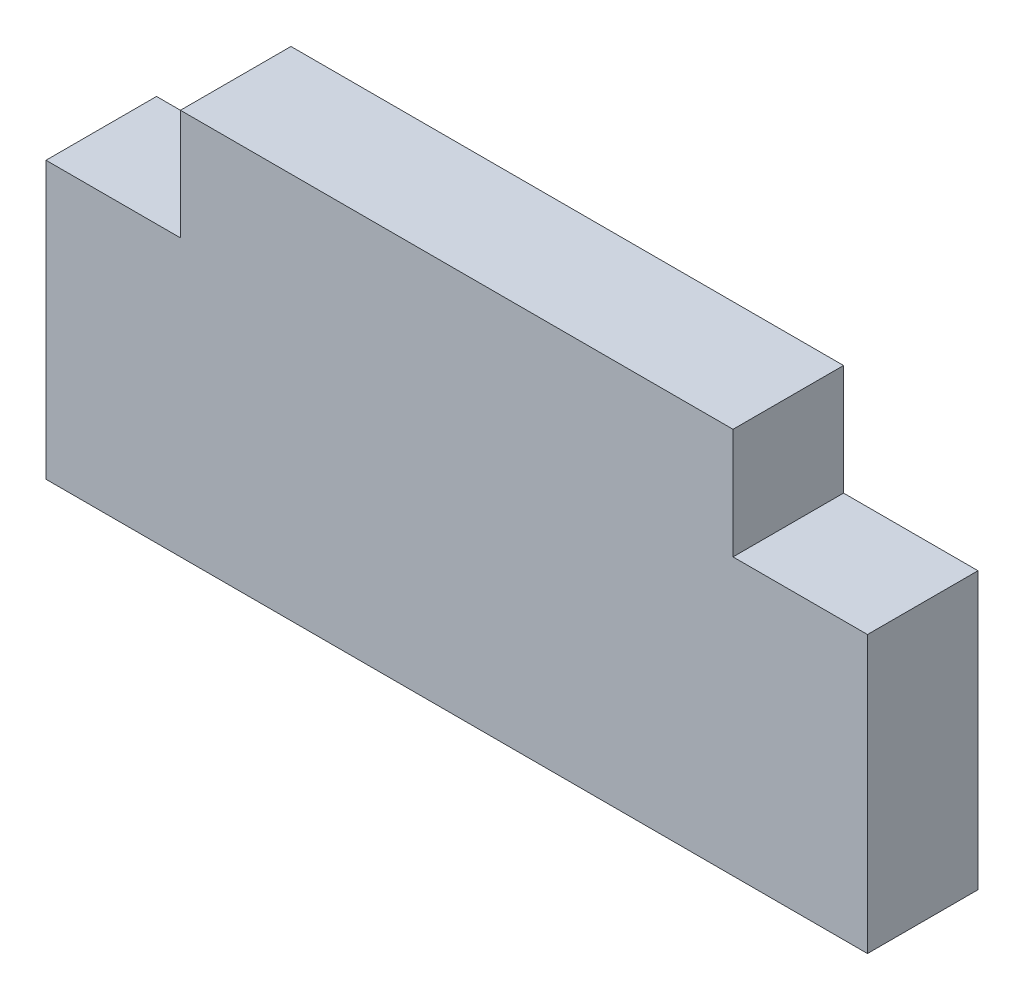
ISO-10303-21;
HEADER;
FILE_DESCRIPTION(('STEP AP214'),'2;1');
FILE_NAME('part.step','',(''),(''),'','','');
FILE_SCHEMA(('AUTOMOTIVE_DESIGN { 1 0 10303 214 1 1 1 1 }'));
ENDSEC;
DATA;
#1=APPLICATION_CONTEXT('core data for automotive mechanical design processes');
#2=APPLICATION_PROTOCOL_DEFINITION('international standard','automotive_design',2000,#1);
#3=PRODUCT_CONTEXT('',#1,'mechanical');
#4=PRODUCT('Part','Part','',(#3));
#5=PRODUCT_RELATED_PRODUCT_CATEGORY('part','',(#4));
#6=PRODUCT_DEFINITION_FORMATION('','',#4);
#7=PRODUCT_DEFINITION_CONTEXT('part definition',#1,'design');
#8=PRODUCT_DEFINITION('design','',#6,#7);
#9=PRODUCT_DEFINITION_SHAPE('','',#8);
#10=(LENGTH_UNIT() NAMED_UNIT(*) SI_UNIT(.MILLI.,.METRE.));
#11=(NAMED_UNIT(*) PLANE_ANGLE_UNIT() SI_UNIT($,.RADIAN.));
#12=(NAMED_UNIT(*) SI_UNIT($,.STERADIAN.) SOLID_ANGLE_UNIT());
#13=UNCERTAINTY_MEASURE_WITH_UNIT(LENGTH_MEASURE(1.E-05),#10,'distance_accuracy_value','');
#14=(GEOMETRIC_REPRESENTATION_CONTEXT(3) GLOBAL_UNCERTAINTY_ASSIGNED_CONTEXT((#13)) GLOBAL_UNIT_ASSIGNED_CONTEXT((#10,
#11,#12)) REPRESENTATION_CONTEXT('',''));
#15=CARTESIAN_POINT('',(0.,0.,0.));
#16=DIRECTION('',(0.,0.,1.));
#17=DIRECTION('',(1.,0.,0.));
#18=AXIS2_PLACEMENT_3D('',#15,#16,#17);
#19=CARTESIAN_POINT('',(0.,5.,0.));
#20=DIRECTION('',(0.,1.,0.));
#21=DIRECTION('',(0.,0.,1.));
#22=AXIS2_PLACEMENT_3D('',#19,#20,#21);
#23=PLANE('',#22);
#24=DIRECTION('',(0.,0.,1.));
#25=VECTOR('',#24,1.);
#26=CARTESIAN_POINT('',(-5.,5.,1.));
#27=LINE('',#26,#25);
#28=CARTESIAN_POINT('',(-5.,5.,-1.));
#29=VERTEX_POINT('',#28);
#30=CARTESIAN_POINT('',(-5.,5.,1.));
#31=VERTEX_POINT('',#30);
#32=EDGE_CURVE('E47',#29,#31,#27,.T.);
#33=ORIENTED_EDGE('',*,*,#32,.F.);
#34=DIRECTION('',(-1.,0.,0.));
#35=VECTOR('',#34,1.);
#36=CARTESIAN_POINT('',(-7.43303437365925,5.,-1.));
#37=LINE('',#36,#35);
#38=CARTESIAN_POINT('',(-7.43303437365925,5.,-1.));
#39=VERTEX_POINT('',#38);
#40=EDGE_CURVE('E136',#29,#39,#37,.T.);
#41=ORIENTED_EDGE('',*,*,#40,.T.);
#42=DIRECTION('',(0.,0.,1.));
#43=VECTOR('',#42,1.);
#44=CARTESIAN_POINT('',(-7.43303437365925,5.,-1.));
#45=LINE('',#44,#43);
#46=CARTESIAN_POINT('',(-7.43303437365925,5.,1.));
#47=VERTEX_POINT('',#46);
#48=EDGE_CURVE('E127',#39,#47,#45,.T.);
#49=ORIENTED_EDGE('',*,*,#48,.T.);
#50=DIRECTION('',(1.,0.,0.));
#51=VECTOR('',#50,1.);
#52=CARTESIAN_POINT('',(-7.43303437365925,5.,1.));
#53=LINE('',#52,#51);
#54=EDGE_CURVE('E132',#47,#31,#53,.T.);
#55=ORIENTED_EDGE('',*,*,#54,.T.);
#56=EDGE_LOOP('',(#33,#41,#49,#55));
#57=FACE_BOUND('',#56,.T.);
#58=ADVANCED_FACE('F32',(#57),#23,.T.);
#59=CARTESIAN_POINT('',(-7.43303437365925,5.,-1.));
#60=DIRECTION('',(1.,0.,0.));
#61=DIRECTION('',(0.,0.,-1.));
#62=AXIS2_PLACEMENT_3D('',#59,#60,#61);
#63=PLANE('',#62);
#64=DIRECTION('',(0.,0.,1.));
#65=VECTOR('',#64,1.);
#66=CARTESIAN_POINT('',(-7.43303437365925,0.,-1.));
#67=LINE('',#66,#65);
#68=CARTESIAN_POINT('',(-7.43303437365925,0.,-1.));
#69=VERTEX_POINT('',#68);
#70=CARTESIAN_POINT('',(-7.43303437365925,0.,1.));
#71=VERTEX_POINT('',#70);
#72=EDGE_CURVE('E118',#69,#71,#67,.T.);
#73=ORIENTED_EDGE('',*,*,#72,.T.);
#74=DIRECTION('',(0.,-1.,0.));
#75=VECTOR('',#74,1.);
#76=CARTESIAN_POINT('',(-7.43303437365925,5.,1.));
#77=LINE('',#76,#75);
#78=EDGE_CURVE('E11',#47,#71,#77,.T.);
#79=ORIENTED_EDGE('',*,*,#78,.F.);
#80=ORIENTED_EDGE('',*,*,#48,.F.);
#81=DIRECTION('',(0.,-1.,0.));
#82=VECTOR('',#81,1.);
#83=CARTESIAN_POINT('',(-7.43303437365925,5.,-1.));
#84=LINE('',#83,#82);
#85=EDGE_CURVE('E138',#39,#69,#84,.T.);
#86=ORIENTED_EDGE('',*,*,#85,.T.);
#87=EDGE_LOOP('',(#73,#79,#80,#86));
#88=FACE_BOUND('',#87,.T.);
#89=ADVANCED_FACE('F34',(#88),#63,.F.);
#90=CARTESIAN_POINT('',(-7.43303437365925,5.,1.));
#91=DIRECTION('',(0.,0.,-1.));
#92=DIRECTION('',(-1.,0.,0.));
#93=AXIS2_PLACEMENT_3D('',#90,#91,#92);
#94=PLANE('',#93);
#95=DIRECTION('',(1.,0.,0.));
#96=VECTOR('',#95,1.);
#97=CARTESIAN_POINT('',(-7.43303437365925,0.,1.));
#98=LINE('',#97,#96);
#99=CARTESIAN_POINT('',(7.43303437365925,0.,1.));
#100=VERTEX_POINT('',#99);
#101=EDGE_CURVE('E121',#71,#100,#98,.T.);
#102=ORIENTED_EDGE('',*,*,#101,.T.);
#103=DIRECTION('',(0.,-1.,0.));
#104=VECTOR('',#103,1.);
#105=CARTESIAN_POINT('',(7.43303437365925,5.,1.));
#106=LINE('',#105,#104);
#107=CARTESIAN_POINT('',(7.43303437365925,5.,1.));
#108=VERTEX_POINT('',#107);
#109=EDGE_CURVE('E40',#108,#100,#106,.T.);
#110=ORIENTED_EDGE('',*,*,#109,.F.);
#111=CARTESIAN_POINT('',(5.,5.,1.));
#112=VERTEX_POINT('',#111);
#113=EDGE_CURVE('E130',#112,#108,#53,.T.);
#114=ORIENTED_EDGE('',*,*,#113,.F.);
#115=DIRECTION('',(0.,-1.,0.));
#116=VECTOR('',#115,1.);
#117=CARTESIAN_POINT('',(5.,7.,1.));
#118=LINE('',#117,#116);
#119=CARTESIAN_POINT('',(5.,7.,1.));
#120=VERTEX_POINT('',#119);
#121=EDGE_CURVE('E103',#120,#112,#118,.T.);
#122=ORIENTED_EDGE('',*,*,#121,.F.);
#123=DIRECTION('',(1.,0.,0.));
#124=VECTOR('',#123,1.);
#125=CARTESIAN_POINT('',(-5.,7.,1.));
#126=LINE('',#125,#124);
#127=CARTESIAN_POINT('',(-5.,7.,1.));
#128=VERTEX_POINT('',#127);
#129=EDGE_CURVE('E97',#128,#120,#126,.T.);
#130=ORIENTED_EDGE('',*,*,#129,.F.);
#131=DIRECTION('',(0.,-1.,0.));
#132=VECTOR('',#131,1.);
#133=CARTESIAN_POINT('',(-5.,7.,1.));
#134=LINE('',#133,#132);
#135=EDGE_CURVE('E101',#128,#31,#134,.T.);
#136=ORIENTED_EDGE('',*,*,#135,.T.);
#137=ORIENTED_EDGE('',*,*,#54,.F.);
#138=ORIENTED_EDGE('',*,*,#78,.T.);
#139=EDGE_LOOP('',(#102,#110,#114,#122,#130,#136,#137,#138));
#140=FACE_BOUND('',#139,.T.);
#141=ADVANCED_FACE('F99',(#140),#94,.F.);
#142=CARTESIAN_POINT('',(7.43303437365925,5.,-1.));
#143=DIRECTION('',(-1.,0.,0.));
#144=DIRECTION('',(0.,0.,1.));
#145=AXIS2_PLACEMENT_3D('',#142,#143,#144);
#146=PLANE('',#145);
#147=DIRECTION('',(0.,0.,-1.));
#148=VECTOR('',#147,1.);
#149=CARTESIAN_POINT('',(7.43303437365925,0.,-1.));
#150=LINE('',#149,#148);
#151=CARTESIAN_POINT('',(7.43303437365925,0.,-1.));
#152=VERTEX_POINT('',#151);
#153=EDGE_CURVE('E141',#100,#152,#150,.T.);
#154=ORIENTED_EDGE('',*,*,#153,.T.);
#155=DIRECTION('',(0.,-1.,0.));
#156=VECTOR('',#155,1.);
#157=CARTESIAN_POINT('',(7.43303437365925,5.,-1.));
#158=LINE('',#157,#156);
#159=CARTESIAN_POINT('',(7.43303437365925,5.,-1.));
#160=VERTEX_POINT('',#159);
#161=EDGE_CURVE('E146',#160,#152,#158,.T.);
#162=ORIENTED_EDGE('',*,*,#161,.F.);
#163=DIRECTION('',(0.,0.,-1.));
#164=VECTOR('',#163,1.);
#165=CARTESIAN_POINT('',(7.43303437365925,5.,-1.));
#166=LINE('',#165,#164);
#167=EDGE_CURVE('E134',#108,#160,#166,.T.);
#168=ORIENTED_EDGE('',*,*,#167,.F.);
#169=ORIENTED_EDGE('',*,*,#109,.T.);
#170=EDGE_LOOP('',(#154,#162,#168,#169));
#171=FACE_BOUND('',#170,.T.);
#172=ADVANCED_FACE('F153',(#171),#146,.F.);
#173=CARTESIAN_POINT('',(-7.43303437365925,5.,-1.));
#174=DIRECTION('',(0.,0.,1.));
#175=DIRECTION('',(1.,0.,0.));
#176=AXIS2_PLACEMENT_3D('',#173,#174,#175);
#177=PLANE('',#176);
#178=DIRECTION('',(-1.,0.,0.));
#179=VECTOR('',#178,1.);
#180=CARTESIAN_POINT('',(-7.43303437365925,0.,-1.));
#181=LINE('',#180,#179);
#182=EDGE_CURVE('E131',#152,#69,#181,.T.);
#183=ORIENTED_EDGE('',*,*,#182,.T.);
#184=ORIENTED_EDGE('',*,*,#85,.F.);
#185=ORIENTED_EDGE('',*,*,#40,.F.);
#186=DIRECTION('',(0.,-1.,0.));
#187=VECTOR('',#186,1.);
#188=CARTESIAN_POINT('',(-5.,7.,-1.));
#189=LINE('',#188,#187);
#190=CARTESIAN_POINT('',(-5.,7.,-1.));
#191=VERTEX_POINT('',#190);
#192=EDGE_CURVE('E166',#191,#29,#189,.T.);
#193=ORIENTED_EDGE('',*,*,#192,.F.);
#194=DIRECTION('',(-1.,0.,0.));
#195=VECTOR('',#194,1.);
#196=CARTESIAN_POINT('',(-5.,7.,-1.));
#197=LINE('',#196,#195);
#198=CARTESIAN_POINT('',(5.,7.,-1.));
#199=VERTEX_POINT('',#198);
#200=EDGE_CURVE('E112',#199,#191,#197,.T.);
#201=ORIENTED_EDGE('',*,*,#200,.F.);
#202=DIRECTION('',(0.,-1.,0.));
#203=VECTOR('',#202,1.);
#204=CARTESIAN_POINT('',(5.,7.,-1.));
#205=LINE('',#204,#203);
#206=CARTESIAN_POINT('',(5.,5.,-1.));
#207=VERTEX_POINT('',#206);
#208=EDGE_CURVE('E123',#199,#207,#205,.T.);
#209=ORIENTED_EDGE('',*,*,#208,.T.);
#210=EDGE_CURVE('E137',#160,#207,#37,.T.);
#211=ORIENTED_EDGE('',*,*,#210,.F.);
#212=ORIENTED_EDGE('',*,*,#161,.T.);
#213=EDGE_LOOP('',(#183,#184,#185,#193,#201,#209,#211,#212));
#214=FACE_BOUND('',#213,.T.);
#215=ADVANCED_FACE('F161',(#214),#177,.F.);
#216=DIRECTION('',(0.,0.,-1.));
#217=VECTOR('',#216,1.);
#218=CARTESIAN_POINT('',(5.,5.,1.));
#219=LINE('',#218,#217);
#220=EDGE_CURVE('E55',#112,#207,#219,.T.);
#221=ORIENTED_EDGE('',*,*,#220,.F.);
#222=ORIENTED_EDGE('',*,*,#113,.T.);
#223=ORIENTED_EDGE('',*,*,#167,.T.);
#224=ORIENTED_EDGE('',*,*,#210,.T.);
#225=EDGE_LOOP('',(#221,#222,#223,#224));
#226=FACE_BOUND('',#225,.T.);
#227=ADVANCED_FACE('F176',(#226),#23,.T.);
#228=CARTESIAN_POINT('',(0.,0.,0.));
#229=DIRECTION('',(0.,1.,0.));
#230=DIRECTION('',(0.,0.,1.));
#231=AXIS2_PLACEMENT_3D('',#228,#229,#230);
#232=PLANE('',#231);
#233=ORIENTED_EDGE('',*,*,#72,.F.);
#234=ORIENTED_EDGE('',*,*,#182,.F.);
#235=ORIENTED_EDGE('',*,*,#153,.F.);
#236=ORIENTED_EDGE('',*,*,#101,.F.);
#237=EDGE_LOOP('',(#233,#234,#235,#236));
#238=FACE_BOUND('',#237,.T.);
#239=ADVANCED_FACE('F158',(#238),#232,.F.);
#240=CARTESIAN_POINT('',(-5.,7.,1.));
#241=DIRECTION('',(1.,0.,0.));
#242=DIRECTION('',(0.,0.,-1.));
#243=AXIS2_PLACEMENT_3D('',#240,#241,#242);
#244=PLANE('',#243);
#245=ORIENTED_EDGE('',*,*,#32,.T.);
#246=ORIENTED_EDGE('',*,*,#135,.F.);
#247=DIRECTION('',(0.,0.,1.));
#248=VECTOR('',#247,1.);
#249=CARTESIAN_POINT('',(-5.,7.,1.));
#250=LINE('',#249,#248);
#251=EDGE_CURVE('E107',#191,#128,#250,.T.);
#252=ORIENTED_EDGE('',*,*,#251,.F.);
#253=ORIENTED_EDGE('',*,*,#192,.T.);
#254=EDGE_LOOP('',(#245,#246,#252,#253));
#255=FACE_BOUND('',#254,.T.);
#256=ADVANCED_FACE('F117',(#255),#244,.F.);
#257=CARTESIAN_POINT('',(5.,7.,1.));
#258=DIRECTION('',(-1.,0.,0.));
#259=DIRECTION('',(0.,0.,1.));
#260=AXIS2_PLACEMENT_3D('',#257,#258,#259);
#261=PLANE('',#260);
#262=ORIENTED_EDGE('',*,*,#220,.T.);
#263=ORIENTED_EDGE('',*,*,#208,.F.);
#264=DIRECTION('',(0.,0.,-1.));
#265=VECTOR('',#264,1.);
#266=CARTESIAN_POINT('',(5.,7.,1.));
#267=LINE('',#266,#265);
#268=EDGE_CURVE('E106',#120,#199,#267,.T.);
#269=ORIENTED_EDGE('',*,*,#268,.F.);
#270=ORIENTED_EDGE('',*,*,#121,.T.);
#271=EDGE_LOOP('',(#262,#263,#269,#270));
#272=FACE_BOUND('',#271,.T.);
#273=ADVANCED_FACE('F175',(#272),#261,.F.);
#274=CARTESIAN_POINT('',(0.,7.,0.));
#275=DIRECTION('',(0.,-1.,0.));
#276=DIRECTION('',(0.,0.,-1.));
#277=AXIS2_PLACEMENT_3D('',#274,#275,#276);
#278=PLANE('',#277);
#279=ORIENTED_EDGE('',*,*,#251,.T.);
#280=ORIENTED_EDGE('',*,*,#129,.T.);
#281=ORIENTED_EDGE('',*,*,#268,.T.);
#282=ORIENTED_EDGE('',*,*,#200,.T.);
#283=EDGE_LOOP('',(#279,#280,#281,#282));
#284=FACE_BOUND('',#283,.T.);
#285=ADVANCED_FACE('F110',(#284),#278,.F.);
#286=CLOSED_SHELL('',(#58,#89,#141,#172,#215,#227,#239,#256,#273,#285));
#287=MANIFOLD_SOLID_BREP('B2',#286);
#288=ADVANCED_BREP_SHAPE_REPRESENTATION('',(#18,#287),#14);
#289=SHAPE_DEFINITION_REPRESENTATION(#9,#288);
ENDSEC;
END-ISO-10303-21;
